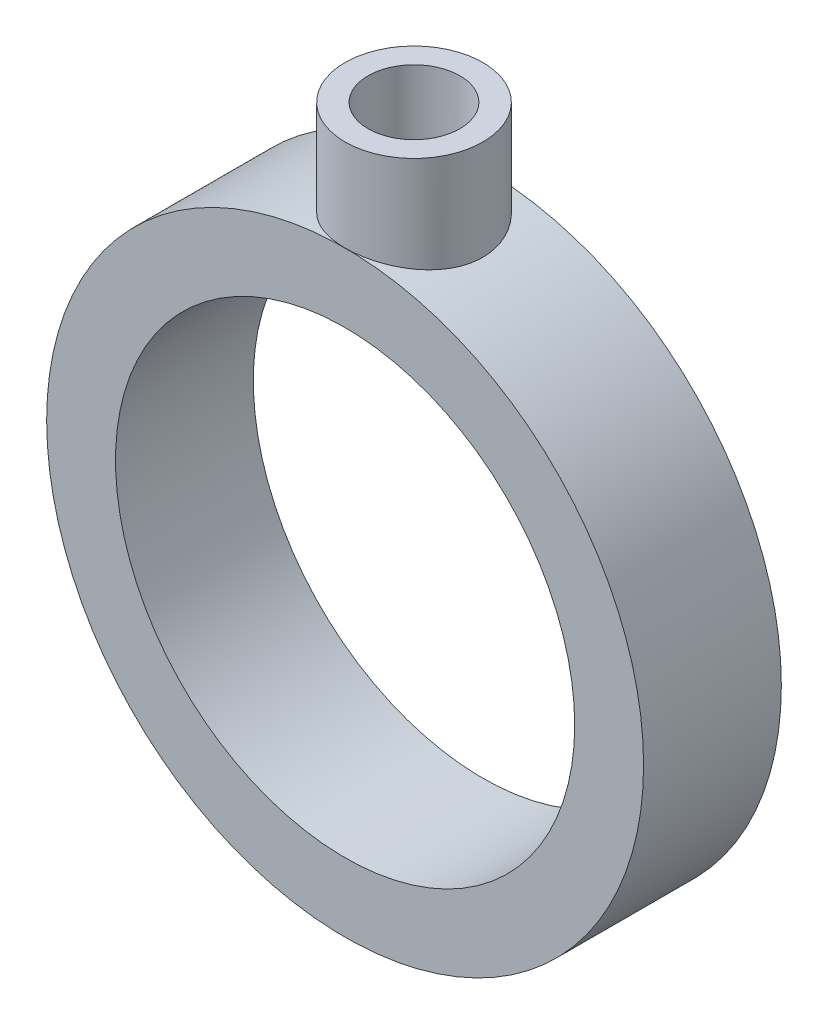
ISO-10303-21;
HEADER;
FILE_DESCRIPTION(('STEP AP214'),'2;1');
FILE_NAME('part.step','',(''),(''),'','','');
FILE_SCHEMA(('AUTOMOTIVE_DESIGN { 1 0 10303 214 1 1 1 1 }'));
ENDSEC;
DATA;
#1=APPLICATION_CONTEXT('core data for automotive mechanical design processes');
#2=APPLICATION_PROTOCOL_DEFINITION('international standard','automotive_design',2000,#1);
#3=PRODUCT_CONTEXT('',#1,'mechanical');
#4=PRODUCT('Part','Part','',(#3));
#5=PRODUCT_RELATED_PRODUCT_CATEGORY('part','',(#4));
#6=PRODUCT_DEFINITION_FORMATION('','',#4);
#7=PRODUCT_DEFINITION_CONTEXT('part definition',#1,'design');
#8=PRODUCT_DEFINITION('design','',#6,#7);
#9=PRODUCT_DEFINITION_SHAPE('','',#8);
#10=(LENGTH_UNIT() NAMED_UNIT(*) SI_UNIT(.MILLI.,.METRE.));
#11=(NAMED_UNIT(*) PLANE_ANGLE_UNIT() SI_UNIT($,.RADIAN.));
#12=(NAMED_UNIT(*) SI_UNIT($,.STERADIAN.) SOLID_ANGLE_UNIT());
#13=UNCERTAINTY_MEASURE_WITH_UNIT(LENGTH_MEASURE(1.E-05),#10,'distance_accuracy_value','');
#14=(GEOMETRIC_REPRESENTATION_CONTEXT(3) GLOBAL_UNCERTAINTY_ASSIGNED_CONTEXT((#13)) GLOBAL_UNIT_ASSIGNED_CONTEXT((#10,
#11,#12)) REPRESENTATION_CONTEXT('',''));
#15=CARTESIAN_POINT('',(0.,0.,0.));
#16=DIRECTION('',(0.,0.,1.));
#17=DIRECTION('',(1.,0.,0.));
#18=AXIS2_PLACEMENT_3D('',#15,#16,#17);
#19=CARTESIAN_POINT('',(0.,0.,3.));
#20=DIRECTION('',(0.,0.,-1.));
#21=DIRECTION('',(-1.,0.,0.));
#22=AXIS2_PLACEMENT_3D('',#19,#20,#21);
#23=CYLINDRICAL_SURFACE('',#22,13.);
#24=CARTESIAN_POINT('',(0.,13.,2.));
#25=CARTESIAN_POINT('',(-0.111634129459772,12.9999981798433,1.99999542300332));
#26=CARTESIAN_POINT('',(-0.223332182929121,12.9985470068655,1.99062180736705));
#27=CARTESIAN_POINT('',(-0.443603799648007,12.9928976712786,1.95338585362346));
#28=CARTESIAN_POINT('',(-0.552174253226696,12.9886968669639,1.92550573504775));
#29=CARTESIAN_POINT('',(-0.762971221767027,12.9780201450358,1.85211155533157));
#30=CARTESIAN_POINT('',(-0.865202549429167,12.9715459788835,1.80661106664727));
#31=CARTESIAN_POINT('',(-1.06056417054209,12.9570371396926,1.69930144504855));
#32=CARTESIAN_POINT('',(-1.15369567594379,12.9490026748879,1.63749448796337));
#33=CARTESIAN_POINT('',(-1.32899277202475,12.9321924031196,1.49878654629));
#34=CARTESIAN_POINT('',(-1.41107292146211,12.923411590907,1.42177817745235));
#35=CARTESIAN_POINT('',(-1.56119998237499,12.9061372591379,1.25508449837165));
#36=CARTESIAN_POINT('',(-1.6292460698243,12.8976437564756,1.16539844426441));
#37=CARTESIAN_POINT('',(-1.74970824234049,12.8818571696186,0.975318277214136));
#38=CARTESIAN_POINT('',(-1.80204125030049,12.874570554198,0.874870930734905));
#39=CARTESIAN_POINT('',(-1.88906073325816,12.8620913537326,0.666481120934637));
#40=CARTESIAN_POINT('',(-1.92374822059573,12.8568986485617,0.558539087994608));
#41=CARTESIAN_POINT('',(-1.97422579132362,12.8492445576298,0.339124209045471));
#42=CARTESIAN_POINT('',(-1.99016243475775,12.8467620000393,0.227685832114845));
#43=CARTESIAN_POINT('',(-2.00314004931484,12.8447450655813,0.00369107009528452));
#44=CARTESIAN_POINT('',(-2.00018216102485,12.8452105107546,-0.108865247098543));
#45=CARTESIAN_POINT('',(-1.97557435962365,12.8490176386625,-0.330863103663462));
#46=CARTESIAN_POINT('',(-1.9540879888833,12.852334155509,-0.440323265109866));
#47=CARTESIAN_POINT('',(-1.89328929394482,12.8614304087006,-0.654066082264418));
#48=CARTESIAN_POINT('',(-1.85397644155405,12.8672102180321,-0.75834858445868));
#49=CARTESIAN_POINT('',(-1.75847159016806,12.8806094791762,-0.95927169770105));
#50=CARTESIAN_POINT('',(-1.7022106216098,12.8882364224677,-1.05587900534495));
#51=CARTESIAN_POINT('',(-1.57445566474822,12.9044652207238,-1.23834374933545));
#52=CARTESIAN_POINT('',(-1.50296062558221,12.9130671429243,-1.32420044344408));
#53=CARTESIAN_POINT('',(-1.3458707741095,12.9303877351212,-1.48367437724266));
#54=CARTESIAN_POINT('',(-1.2601354172487,12.939106680676,-1.55715321407389));
#55=CARTESIAN_POINT('',(-1.07747683573123,12.9555948808269,-1.68870090383103));
#56=CARTESIAN_POINT('',(-0.980553557370509,12.9633641308639,-1.74676968278146));
#57=CARTESIAN_POINT('',(-0.778148209221874,12.977086290908,-1.84585722519084));
#58=CARTESIAN_POINT('',(-0.672660659263364,12.9830380261278,-1.88686496708427));
#59=CARTESIAN_POINT('',(-0.456184081690752,12.992444828946,-1.95054425674362));
#60=CARTESIAN_POINT('',(-0.345195446112753,12.9959000741847,-1.97321710916126));
#61=CARTESIAN_POINT('',(-0.122061413656298,12.999900977609,-1.99939818817922));
#62=CARTESIAN_POINT('',(-0.00993883414831808,13.000475512886,-2.00309662866594));
#63=CARTESIAN_POINT('',(0.213325058692731,12.9987289757846,-1.99172928039578));
#64=CARTESIAN_POINT('',(0.324466403910715,12.9964079978465,-1.97666410363391));
#65=CARTESIAN_POINT('',(0.542034248496511,12.9891490837857,-1.92835534939112));
#66=CARTESIAN_POINT('',(0.648481883728961,12.9842245404646,-1.89520477603376));
#67=CARTESIAN_POINT('',(0.854308287939675,12.9723087739691,-1.81176456563786));
#68=CARTESIAN_POINT('',(0.953686709856465,12.9653174494133,-1.76147408782045));
#69=CARTESIAN_POINT('',(1.14338785915144,12.9499729976666,-1.64473773321354));
#70=CARTESIAN_POINT('',(1.23363576499287,12.94160989393,-1.57817160424487));
#71=CARTESIAN_POINT('',(1.40174739518524,12.9244828841827,-1.43094049058091));
#72=CARTESIAN_POINT('',(1.47961035974428,12.9157189536244,-1.35027464153208));
#73=CARTESIAN_POINT('',(1.62143687177062,12.8986860695372,-1.17628566905066));
#74=CARTESIAN_POINT('',(1.68527268254131,12.8904221246483,-1.08285785594592));
#75=CARTESIAN_POINT('',(1.79634400375255,12.8754146609527,-0.886493623548419));
#76=CARTESIAN_POINT('',(1.84357998078108,12.8686710994129,-0.78355747161868));
#77=CARTESIAN_POINT('',(1.91991433220861,12.8575044908204,-0.571474165015271));
#78=CARTESIAN_POINT('',(1.94907911782486,12.8530729567255,-0.462351380158461));
#79=CARTESIAN_POINT('',(1.98865407244709,12.8470098709954,-0.240682987796808));
#80=CARTESIAN_POINT('',(1.99906561003298,12.8453781150375,-0.128137630675036));
#81=CARTESIAN_POINT('',(2.00080471457037,12.8451072329882,0.0959074702454619));
#82=CARTESIAN_POINT('',(1.99233317092469,12.8464366045642,0.207405668335099));
#83=CARTESIAN_POINT('',(1.95697794807654,12.8518695985565,0.427371210054106));
#84=CARTESIAN_POINT('',(1.93009430462956,12.8559732155853,0.535838559568827));
#85=CARTESIAN_POINT('',(1.85875038208619,12.8664810988442,0.746602841237628));
#86=CARTESIAN_POINT('',(1.81430487035791,12.8728834317255,0.848904874579072));
#87=CARTESIAN_POINT('',(1.7091189717658,12.8872696044033,1.04463266898111));
#88=CARTESIAN_POINT('',(1.64837797557981,12.8952535033351,1.13805809795002));
#89=CARTESIAN_POINT('',(1.51159830040354,12.9120041996598,1.31440009714407));
#90=CARTESIAN_POINT('',(1.43541104590757,12.9207781015993,1.39720076396871));
#91=CARTESIAN_POINT('',(1.27021551598636,12.9380614876198,1.54891276196269));
#92=CARTESIAN_POINT('',(1.18120427010544,12.9465709098818,1.61782086626289));
#93=CARTESIAN_POINT('',(0.992277722296824,12.9624232087798,1.74015121411183));
#94=CARTESIAN_POINT('',(0.892302099536091,12.9697590240101,1.79348120339238));
#95=CARTESIAN_POINT('',(0.68474512681887,12.9823684829832,1.88251146342835));
#96=CARTESIAN_POINT('',(0.577171717906741,12.9876442432633,1.91822983864098));
#97=CARTESIAN_POINT('',(0.390941400069084,12.9943465728122,1.96299713746939));
#98=CARTESIAN_POINT('',(0.313429175326516,12.9964556222015,1.97685178146002));
#99=CARTESIAN_POINT('',(0.157288536394365,12.9992829677305,1.99535476350691));
#100=CARTESIAN_POINT('',(0.0786601371924722,13.0000012825269,2.00000322506377));
#101=CARTESIAN_POINT('',(0.,13.,2.));
#102=B_SPLINE_CURVE_WITH_KNOTS('',3,(#24,#25,#26,#27,#28,#29,#30,#31,#32,#33,#34,#35,#36,#37,
#38,#39,#40,#41,#42,#43,#44,#45,#46,#47,#48,#49,#50,#51,#52,#53,#54,#55,#56,#57,#58,#59,#60,#61,
#62,#63,#64,#65,#66,#67,#68,#69,#70,#71,#72,#73,#74,#75,#76,#77,#78,#79,#80,#81,#82,#83,#84,#85,
#86,#87,#88,#89,#90,#91,#92,#93,#94,#95,#96,#97,#98,#99,#100,#101),.UNSPECIFIED.,.T.,.F.,(4,2,2,
2,2,2,2,2,2,2,2,2,2,2,2,2,2,2,2,2,2,2,2,2,2,2,2,2,2,2,2,2,2,2,2,2,2,2,4),(0.,0.334614935402754,
0.669551824578953,1.00423123317535,1.33886600689116,1.6759552066042,2.0130641932687,
2.35192534458354,2.69076705292645,3.02694233717946,3.36309732807122,3.69631525463016,
4.02954305496923,4.36414566185345,4.69877135746454,5.03692069824302,5.37507166226688,
5.71344073657471,6.05178573150937,6.38673217834278,6.72166770083347,7.05489683473247,
7.38814231716764,7.72392860544463,8.05973548561447,8.39848409534481,8.73722318277052,
9.07470991155934,9.41217201014685,9.74606114027121,10.0799496219992,10.4135579400877,
10.7471787342265,11.0841753844584,11.4212502200089,11.7602825362116,12.0989656022034,
12.3347466304,12.5705244955816),.UNSPECIFIED.);
#103=CARTESIAN_POINT('',(0.,13.,2.));
#104=VERTEX_POINT('',#103);
#105=EDGE_CURVE('E51',#104,#104,#102,.T.);
#106=ORIENTED_EDGE('',*,*,#105,.F.);
#107=EDGE_LOOP('',(#106));
#108=FACE_BOUND('',#107,.T.);
#109=CARTESIAN_POINT('',(0.,13.,3.));
#110=CARTESIAN_POINT('',(0.166152344952669,12.9999969906573,2.99999466928822));
#111=CARTESIAN_POINT('',(0.332367205973653,12.9967824842909,2.98615014637782));
#112=CARTESIAN_POINT('',(0.660059866493254,12.9842700075106,2.9312047142287));
#113=CARTESIAN_POINT('',(0.821534467366725,12.9749680237034,2.89008582311719));
#114=CARTESIAN_POINT('',(1.13496480129888,12.9513142129353,2.78196060211815));
#115=CARTESIAN_POINT('',(1.28693082086391,12.936967958219,2.71498282973731));
#116=CARTESIAN_POINT('',(1.577465910561,12.904766336637,2.55713546986327));
#117=CARTESIAN_POINT('',(1.71603502567188,12.8869109815535,2.46626596258808));
#118=CARTESIAN_POINT('',(1.97830470624641,12.8492864660987,2.26150949664556));
#119=CARTESIAN_POINT('',(2.10173358432239,12.8294913730764,2.14727927659515));
#120=CARTESIAN_POINT('',(2.32786120795392,12.7903971901517,1.89978014685717));
#121=CARTESIAN_POINT('',(2.43055793299828,12.7710981487534,1.76650938367844));
#122=CARTESIAN_POINT('',(2.61353391505112,12.7349234835873,1.48266614487996));
#123=CARTESIAN_POINT('',(2.69351850955545,12.7180809816988,1.33189911804872));
#124=CARTESIAN_POINT('',(2.82690790660153,12.6891009206901,1.01860980269649));
#125=CARTESIAN_POINT('',(2.88031627708408,12.6769627300499,0.856089095500928));
#126=CARTESIAN_POINT('',(2.95812848517193,12.659030692131,0.526868396835621));
#127=CARTESIAN_POINT('',(2.98301618993589,12.6531311408672,0.360288653266906));
#128=CARTESIAN_POINT('',(3.00458614092873,12.6480272975283,0.0252218259293454));
#129=CARTESIAN_POINT('',(3.00127226312641,12.6488220853967,-0.143264992556277));
#130=CARTESIAN_POINT('',(2.96692126571465,12.6569216667427,-0.473725615648721));
#131=CARTESIAN_POINT('',(2.93645150630372,12.6640932250769,-0.635762162688184));
#132=CARTESIAN_POINT('',(2.8495548295868,12.683927027642,-0.952359583802944));
#133=CARTESIAN_POINT('',(2.79312630925338,12.6965896109567,-1.10691999555408));
#134=CARTESIAN_POINT('',(2.65540698150097,12.726106644567,-1.40574534328195));
#135=CARTESIAN_POINT('',(2.57390258493056,12.7429968648251,-1.54990816182197));
#136=CARTESIAN_POINT('',(2.3884949795051,12.7790447936328,-1.82271847257873));
#137=CARTESIAN_POINT('',(2.28458839291061,12.7982028439228,-1.95136362051804));
#138=CARTESIAN_POINT('',(2.05434642172906,12.8371955528176,-2.19274790010195));
#139=CARTESIAN_POINT('',(1.92752990169011,12.8570353769547,-2.30502777024993));
#140=CARTESIAN_POINT('',(1.65663728210681,12.8947363213875,-2.50680614195071));
#141=CARTESIAN_POINT('',(1.51256079749006,12.91259739752,-2.59630413509717));
#142=CARTESIAN_POINT('',(1.21064255594474,12.94439708166,-2.75011182828663));
#143=CARTESIAN_POINT('',(1.0527662865885,12.9583254640484,-2.81435603138533));
#144=CARTESIAN_POINT('',(0.728064792505166,12.980615159728,-2.9152722873901));
#145=CARTESIAN_POINT('',(0.561241024748476,12.9889773764326,-2.95194881477694));
#146=CARTESIAN_POINT('',(0.227314647863281,12.999062058904,-2.99600830069629));
#147=CARTESIAN_POINT('',(0.0602988900254598,13.0009265305377,-3.00401787211947));
#148=CARTESIAN_POINT('',(-0.272684743158447,12.9982059982626,-2.99222197048143));
#149=CARTESIAN_POINT('',(-0.438652697125491,12.9936214841662,-2.972418609864));
#150=CARTESIAN_POINT('',(-0.762715807596045,12.9786082469926,-2.90607760678847));
#151=CARTESIAN_POINT('',(-0.920882929751393,12.968252478837,-2.85987351736574));
#152=CARTESIAN_POINT('',(-1.22721924496333,12.9428582085761,-2.74241682215124));
#153=CARTESIAN_POINT('',(-1.3753875214532,12.9278192778858,-2.67116192372823));
#154=CARTESIAN_POINT('',(-1.66007523022035,12.8943799217624,-2.50435471215811));
#155=CARTESIAN_POINT('',(-1.79637682059256,12.8759307059183,-2.4084406162299));
#156=CARTESIAN_POINT('',(-2.05117436096366,12.8378078382851,-2.19550876528259));
#157=CARTESIAN_POINT('',(-2.16966771329558,12.8181340084537,-2.07848793691579));
#158=CARTESIAN_POINT('',(-2.38800205666,12.7792809496474,-1.82377522824305));
#159=CARTESIAN_POINT('',(-2.48740687177955,12.7601203499969,-1.68570607064937));
#160=CARTESIAN_POINT('',(-2.66162470892947,12.7249237700036,-1.39446823956527));
#161=CARTESIAN_POINT('',(-2.73643882449717,12.7088876507294,-1.24130023790751));
#162=CARTESIAN_POINT('',(-2.85882133736006,12.6819190230073,-0.925048023164727));
#163=CARTESIAN_POINT('',(-2.90654808960746,12.6709569224205,-0.762027740678969));
#164=CARTESIAN_POINT('',(-2.9738506135118,12.6553320099168,-0.429992014353495));
#165=CARTESIAN_POINT('',(-2.99343148198756,12.6506680575041,-0.260977661636089));
#166=CARTESIAN_POINT('',(-3.00365072031913,12.6482450687886,0.0738364541144728));
#167=CARTESIAN_POINT('',(-2.99498255743034,12.6503205850391,0.239614221299587));
#168=CARTESIAN_POINT('',(-2.95051371961671,12.6607654071459,0.56727735733389));
#169=CARTESIAN_POINT('',(-2.91471344248813,12.6691346207273,0.729162783214562));
#170=CARTESIAN_POINT('',(-2.81734841440311,12.6911387833219,1.04381982158291));
#171=CARTESIAN_POINT('',(-2.7558954206715,12.7047508718617,1.19662772141188));
#172=CARTESIAN_POINT('',(-2.60906164454194,12.7357136622437,1.48986361308248));
#173=CARTESIAN_POINT('',(-2.52367805163027,12.7530648031611,1.63029014825466));
#174=CARTESIAN_POINT('',(-2.32915359032528,12.7900365874876,1.8981710571802));
#175=CARTESIAN_POINT('',(-2.21952324066575,12.8096993736488,2.02526423909917));
#176=CARTESIAN_POINT('',(-1.98059542918642,12.8488080487622,2.25947649527657));
#177=CARTESIAN_POINT('',(-1.85129339204876,12.8682538861233,2.36659090986055));
#178=CARTESIAN_POINT('',(-1.57438386552311,12.9050799859908,2.55933453589763));
#179=CARTESIAN_POINT('',(-1.42653373816978,12.9224254113505,2.64462223657955));
#180=CARTESIAN_POINT('',(-1.11821928295074,12.9527409110575,2.78899829881722));
#181=CARTESIAN_POINT('',(-0.957765094203872,12.9657144587282,2.84810747020586));
#182=CARTESIAN_POINT('',(-0.664420748397538,12.9836544679345,2.92855694711147));
#183=CARTESIAN_POINT('',(-0.533052734642019,12.989744579336,2.955294542054));
#184=CARTESIAN_POINT('',(-0.267803260561671,12.9979184490222,2.99101773322944));
#185=CARTESIAN_POINT('',(-0.133921937579662,13.0000024255872,3.00000429665468));
#186=CARTESIAN_POINT('',(0.,13.,3.));
#187=B_SPLINE_CURVE_WITH_KNOTS('',3,(#109,#110,#111,#112,#113,#114,#115,#116,#117,#118,#119,
#120,#121,#122,#123,#124,#125,#126,#127,#128,#129,#130,#131,#132,#133,#134,#135,#136,#137,#138,
#139,#140,#141,#142,#143,#144,#145,#146,#147,#148,#149,#150,#151,#152,#153,#154,#155,#156,#157,
#158,#159,#160,#161,#162,#163,#164,#165,#166,#167,#168,#169,#170,#171,#172,#173,#174,#175,#176,
#177,#178,#179,#180,#181,#182,#183,#184,#185,#186),.UNSPECIFIED.,.T.,.F.,(4,2,2,2,2,2,2,2,2,2,2,
2,2,2,2,2,2,2,2,2,2,2,2,2,2,2,2,2,2,2,2,2,2,2,2,2,2,2,4),(0.,0.497966622434228,
0.996261878862197,1.49400840494549,1.9917532598344,2.49741860444443,3.00313320634929,
3.51513680218821,4.02707164139241,4.53018632285289,5.03323185836015,5.52600755521466,
6.01881368645778,6.51593939429341,7.01314010983494,7.52235052563831,8.03157230411895,
8.54210619550815,9.05255720476822,9.55178002870641,10.0509649377955,10.5439782351977,
11.0370366645577,11.5377886750691,12.0386136589454,12.5497908111456,13.0609452284513,
13.5690797726974,14.0771222894149,14.5727880288599,15.0684465012649,15.5619677862172,
16.0555470567626,16.5601864742807,17.0649434427466,17.5771721946325,18.088993031651,
18.4903854337741,18.8917559648093),.UNSPECIFIED.);
#188=CARTESIAN_POINT('',(0.,13.,3.));
#189=VERTEX_POINT('',#188);
#190=EDGE_CURVE('E47',#189,#189,#187,.T.);
#191=ORIENTED_EDGE('',*,*,#190,.F.);
#192=EDGE_LOOP('',(#191));
#193=FACE_BOUND('',#192,.T.);
#194=ADVANCED_FACE('F39',(#108,#193),#23,.F.);
#195=CARTESIAN_POINT('',(0.,17.,0.));
#196=DIRECTION('',(0.,1.,0.));
#197=DIRECTION('',(0.,0.,1.));
#198=AXIS2_PLACEMENT_3D('',#195,#196,#197);
#199=PLANE('',#198);
#200=CARTESIAN_POINT('',(0.,17.,0.));
#201=DIRECTION('',(0.,1.,0.));
#202=DIRECTION('',(0.,0.,1.));
#203=AXIS2_PLACEMENT_3D('',#200,#201,#202);
#204=CIRCLE('',#203,2.);
#205=CARTESIAN_POINT('',(0.,17.,2.));
#206=VERTEX_POINT('',#205);
#207=EDGE_CURVE('E55',#206,#206,#204,.T.);
#208=ORIENTED_EDGE('',*,*,#207,.F.);
#209=EDGE_LOOP('',(#208));
#210=FACE_BOUND('',#209,.T.);
#211=CARTESIAN_POINT('',(0.,17.,0.));
#212=DIRECTION('',(0.,1.,0.));
#213=DIRECTION('',(0.,0.,1.));
#214=AXIS2_PLACEMENT_3D('',#211,#212,#213);
#215=CIRCLE('',#214,3.);
#216=CARTESIAN_POINT('',(0.,17.,3.));
#217=VERTEX_POINT('',#216);
#218=EDGE_CURVE('E11',#217,#217,#215,.T.);
#219=ORIENTED_EDGE('',*,*,#218,.T.);
#220=EDGE_LOOP('',(#219));
#221=FACE_BOUND('',#220,.T.);
#222=ADVANCED_FACE('F68',(#210,#221),#199,.T.);
#223=CARTESIAN_POINT('',(0.,-13.002,0.));
#224=DIRECTION('',(0.,1.,0.));
#225=DIRECTION('',(0.,0.,1.));
#226=AXIS2_PLACEMENT_3D('',#223,#224,#225);
#227=CYLINDRICAL_SURFACE('',#226,3.);
#228=ORIENTED_EDGE('',*,*,#218,.F.);
#229=EDGE_LOOP('',(#228));
#230=FACE_BOUND('',#229,.T.);
#231=ORIENTED_EDGE('',*,*,#190,.T.);
#232=EDGE_LOOP('',(#231));
#233=FACE_BOUND('',#232,.T.);
#234=ADVANCED_FACE('F41',(#230,#233),#227,.T.);
#235=CARTESIAN_POINT('',(0.,7.,0.));
#236=DIRECTION('',(0.,1.,0.));
#237=DIRECTION('',(0.,0.,1.));
#238=AXIS2_PLACEMENT_3D('',#235,#236,#237);
#239=CYLINDRICAL_SURFACE('',#238,2.);
#240=ORIENTED_EDGE('',*,*,#105,.T.);
#241=EDGE_LOOP('',(#240));
#242=FACE_BOUND('',#241,.T.);
#243=ORIENTED_EDGE('',*,*,#207,.T.);
#244=EDGE_LOOP('',(#243));
#245=FACE_BOUND('',#244,.T.);
#246=ADVANCED_FACE('F73',(#242,#245),#239,.F.);
#247=CLOSED_SHELL('',(#194,#222,#234,#246));
#248=MANIFOLD_SOLID_BREP('B2',#247);
#249=CARTESIAN_POINT('',(0.,0.,3.));
#250=DIRECTION('',(0.,0.,1.));
#251=DIRECTION('',(1.,0.,0.));
#252=AXIS2_PLACEMENT_3D('',#249,#250,#251);
#253=PLANE('',#252);
#254=CARTESIAN_POINT('',(0.,0.,3.));
#255=DIRECTION('',(0.,0.,1.));
#256=DIRECTION('',(1.,0.,0.));
#257=AXIS2_PLACEMENT_3D('',#254,#255,#256);
#258=CIRCLE('',#257,13.);
#259=CARTESIAN_POINT('',(13.,0.,3.));
#260=VERTEX_POINT('',#259);
#261=EDGE_CURVE('E38',#260,#260,#258,.T.);
#262=ORIENTED_EDGE('',*,*,#261,.T.);
#263=EDGE_LOOP('',(#262));
#264=FACE_BOUND('',#263,.T.);
#265=CARTESIAN_POINT('',(0.,0.,3.));
#266=DIRECTION('',(0.,0.,1.));
#267=DIRECTION('',(1.,0.,0.));
#268=AXIS2_PLACEMENT_3D('',#265,#266,#267);
#269=CIRCLE('',#268,10.);
#270=CARTESIAN_POINT('',(10.,0.,3.));
#271=VERTEX_POINT('',#270);
#272=EDGE_CURVE('E130',#271,#271,#269,.T.);
#273=ORIENTED_EDGE('',*,*,#272,.F.);
#274=EDGE_LOOP('',(#273));
#275=FACE_BOUND('',#274,.T.);
#276=ADVANCED_FACE('F111',(#264,#275),#253,.T.);
#277=CARTESIAN_POINT('',(0.,0.,-3.));
#278=DIRECTION('',(0.,0.,1.));
#279=DIRECTION('',(1.,0.,0.));
#280=AXIS2_PLACEMENT_3D('',#277,#278,#279);
#281=PLANE('',#280);
#282=CARTESIAN_POINT('',(0.,0.,-3.));
#283=DIRECTION('',(0.,0.,1.));
#284=DIRECTION('',(1.,0.,0.));
#285=AXIS2_PLACEMENT_3D('',#282,#283,#284);
#286=CIRCLE('',#285,13.);
#287=CARTESIAN_POINT('',(13.,0.,-3.));
#288=VERTEX_POINT('',#287);
#289=EDGE_CURVE('E125',#288,#288,#286,.T.);
#290=ORIENTED_EDGE('',*,*,#289,.F.);
#291=EDGE_LOOP('',(#290));
#292=FACE_BOUND('',#291,.T.);
#293=CARTESIAN_POINT('',(0.,0.,-3.));
#294=DIRECTION('',(0.,0.,1.));
#295=DIRECTION('',(1.,0.,0.));
#296=AXIS2_PLACEMENT_3D('',#293,#294,#295);
#297=CIRCLE('',#296,10.);
#298=CARTESIAN_POINT('',(10.,0.,-3.));
#299=VERTEX_POINT('',#298);
#300=EDGE_CURVE('E132',#299,#299,#297,.T.);
#301=ORIENTED_EDGE('',*,*,#300,.T.);
#302=EDGE_LOOP('',(#301));
#303=FACE_BOUND('',#302,.T.);
#304=ADVANCED_FACE('F153',(#292,#303),#281,.F.);
#305=CARTESIAN_POINT('',(0.,0.,3.));
#306=DIRECTION('',(0.,0.,-1.));
#307=DIRECTION('',(-1.,0.,0.));
#308=AXIS2_PLACEMENT_3D('',#305,#306,#307);
#309=CYLINDRICAL_SURFACE('',#308,13.);
#310=CARTESIAN_POINT('',(0.,13.,2.));
#311=CARTESIAN_POINT('',(-0.111634129459772,12.9999981798433,1.99999542300332));
#312=CARTESIAN_POINT('',(-0.223332182929121,12.9985470068655,1.99062180736705));
#313=CARTESIAN_POINT('',(-0.443603799648007,12.9928976712786,1.95338585362346));
#314=CARTESIAN_POINT('',(-0.552174253226696,12.9886968669639,1.92550573504775));
#315=CARTESIAN_POINT('',(-0.762971221767027,12.9780201450358,1.85211155533157));
#316=CARTESIAN_POINT('',(-0.865202549429167,12.9715459788835,1.80661106664727));
#317=CARTESIAN_POINT('',(-1.06056417054209,12.9570371396926,1.69930144504855));
#318=CARTESIAN_POINT('',(-1.15369567594379,12.9490026748879,1.63749448796337));
#319=CARTESIAN_POINT('',(-1.32899277202475,12.9321924031196,1.49878654629));
#320=CARTESIAN_POINT('',(-1.41107292146211,12.923411590907,1.42177817745235));
#321=CARTESIAN_POINT('',(-1.56119998237499,12.9061372591379,1.25508449837165));
#322=CARTESIAN_POINT('',(-1.6292460698243,12.8976437564756,1.16539844426441));
#323=CARTESIAN_POINT('',(-1.74970824234049,12.8818571696186,0.975318277214136));
#324=CARTESIAN_POINT('',(-1.80204125030049,12.874570554198,0.874870930734905));
#325=CARTESIAN_POINT('',(-1.88906073325816,12.8620913537326,0.666481120934637));
#326=CARTESIAN_POINT('',(-1.92374822059573,12.8568986485617,0.558539087994608));
#327=CARTESIAN_POINT('',(-1.97422579132362,12.8492445576298,0.339124209045471));
#328=CARTESIAN_POINT('',(-1.99016243475775,12.8467620000393,0.227685832114845));
#329=CARTESIAN_POINT('',(-2.00314004931484,12.8447450655813,0.00369107009528452));
#330=CARTESIAN_POINT('',(-2.00018216102485,12.8452105107546,-0.108865247098543));
#331=CARTESIAN_POINT('',(-1.97557435962365,12.8490176386625,-0.330863103663462));
#332=CARTESIAN_POINT('',(-1.9540879888833,12.852334155509,-0.440323265109866));
#333=CARTESIAN_POINT('',(-1.89328929394482,12.8614304087006,-0.654066082264418));
#334=CARTESIAN_POINT('',(-1.85397644155405,12.8672102180321,-0.75834858445868));
#335=CARTESIAN_POINT('',(-1.75847159016806,12.8806094791762,-0.95927169770105));
#336=CARTESIAN_POINT('',(-1.7022106216098,12.8882364224677,-1.05587900534495));
#337=CARTESIAN_POINT('',(-1.57445566474822,12.9044652207238,-1.23834374933545));
#338=CARTESIAN_POINT('',(-1.50296062558221,12.9130671429243,-1.32420044344408));
#339=CARTESIAN_POINT('',(-1.3458707741095,12.9303877351212,-1.48367437724266));
#340=CARTESIAN_POINT('',(-1.2601354172487,12.939106680676,-1.55715321407389));
#341=CARTESIAN_POINT('',(-1.07747683573123,12.9555948808269,-1.68870090383103));
#342=CARTESIAN_POINT('',(-0.980553557370509,12.9633641308639,-1.74676968278146));
#343=CARTESIAN_POINT('',(-0.778148209221874,12.977086290908,-1.84585722519084));
#344=CARTESIAN_POINT('',(-0.672660659263364,12.9830380261278,-1.88686496708427));
#345=CARTESIAN_POINT('',(-0.456184081690752,12.992444828946,-1.95054425674362));
#346=CARTESIAN_POINT('',(-0.345195446112753,12.9959000741847,-1.97321710916126));
#347=CARTESIAN_POINT('',(-0.122061413656298,12.999900977609,-1.99939818817922));
#348=CARTESIAN_POINT('',(-0.00993883414831808,13.000475512886,-2.00309662866594));
#349=CARTESIAN_POINT('',(0.213325058692731,12.9987289757846,-1.99172928039578));
#350=CARTESIAN_POINT('',(0.324466403910715,12.9964079978465,-1.97666410363391));
#351=CARTESIAN_POINT('',(0.542034248496511,12.9891490837857,-1.92835534939112));
#352=CARTESIAN_POINT('',(0.648481883728961,12.9842245404646,-1.89520477603376));
#353=CARTESIAN_POINT('',(0.854308287939675,12.9723087739691,-1.81176456563786));
#354=CARTESIAN_POINT('',(0.953686709856465,12.9653174494133,-1.76147408782045));
#355=CARTESIAN_POINT('',(1.14338785915144,12.9499729976666,-1.64473773321354));
#356=CARTESIAN_POINT('',(1.23363576499287,12.94160989393,-1.57817160424487));
#357=CARTESIAN_POINT('',(1.40174739518524,12.9244828841827,-1.43094049058091));
#358=CARTESIAN_POINT('',(1.47961035974428,12.9157189536244,-1.35027464153208));
#359=CARTESIAN_POINT('',(1.62143687177062,12.8986860695372,-1.17628566905066));
#360=CARTESIAN_POINT('',(1.68527268254131,12.8904221246483,-1.08285785594592));
#361=CARTESIAN_POINT('',(1.79634400375255,12.8754146609527,-0.886493623548419));
#362=CARTESIAN_POINT('',(1.84357998078108,12.8686710994129,-0.78355747161868));
#363=CARTESIAN_POINT('',(1.91991433220861,12.8575044908204,-0.571474165015271));
#364=CARTESIAN_POINT('',(1.94907911782486,12.8530729567255,-0.462351380158461));
#365=CARTESIAN_POINT('',(1.98865407244709,12.8470098709954,-0.240682987796808));
#366=CARTESIAN_POINT('',(1.99906561003298,12.8453781150375,-0.128137630675036));
#367=CARTESIAN_POINT('',(2.00080471457037,12.8451072329882,0.0959074702454619));
#368=CARTESIAN_POINT('',(1.99233317092469,12.8464366045642,0.207405668335099));
#369=CARTESIAN_POINT('',(1.95697794807654,12.8518695985565,0.427371210054106));
#370=CARTESIAN_POINT('',(1.93009430462956,12.8559732155853,0.535838559568827));
#371=CARTESIAN_POINT('',(1.85875038208619,12.8664810988442,0.746602841237628));
#372=CARTESIAN_POINT('',(1.81430487035791,12.8728834317255,0.848904874579072));
#373=CARTESIAN_POINT('',(1.7091189717658,12.8872696044033,1.04463266898111));
#374=CARTESIAN_POINT('',(1.64837797557981,12.8952535033351,1.13805809795002));
#375=CARTESIAN_POINT('',(1.51159830040354,12.9120041996598,1.31440009714407));
#376=CARTESIAN_POINT('',(1.43541104590757,12.9207781015993,1.39720076396871));
#377=CARTESIAN_POINT('',(1.27021551598636,12.9380614876198,1.54891276196269));
#378=CARTESIAN_POINT('',(1.18120427010544,12.9465709098818,1.61782086626289));
#379=CARTESIAN_POINT('',(0.992277722296824,12.9624232087798,1.74015121411183));
#380=CARTESIAN_POINT('',(0.892302099536091,12.9697590240101,1.79348120339238));
#381=CARTESIAN_POINT('',(0.68474512681887,12.9823684829832,1.88251146342835));
#382=CARTESIAN_POINT('',(0.577171717906741,12.9876442432633,1.91822983864098));
#383=CARTESIAN_POINT('',(0.390941400069084,12.9943465728122,1.96299713746939));
#384=CARTESIAN_POINT('',(0.313429175326516,12.9964556222015,1.97685178146002));
#385=CARTESIAN_POINT('',(0.157288536394365,12.9992829677305,1.99535476350691));
#386=CARTESIAN_POINT('',(0.0786601371924722,13.0000012825269,2.00000322506377));
#387=CARTESIAN_POINT('',(0.,13.,2.));
#388=B_SPLINE_CURVE_WITH_KNOTS('',3,(#310,#311,#312,#313,#314,#315,#316,#317,#318,#319,#320,
#321,#322,#323,#324,#325,#326,#327,#328,#329,#330,#331,#332,#333,#334,#335,#336,#337,#338,#339,
#340,#341,#342,#343,#344,#345,#346,#347,#348,#349,#350,#351,#352,#353,#354,#355,#356,#357,#358,
#359,#360,#361,#362,#363,#364,#365,#366,#367,#368,#369,#370,#371,#372,#373,#374,#375,#376,#377,
#378,#379,#380,#381,#382,#383,#384,#385,#386,#387),.UNSPECIFIED.,.T.,.F.,(4,2,2,2,2,2,2,2,2,2,2,
2,2,2,2,2,2,2,2,2,2,2,2,2,2,2,2,2,2,2,2,2,2,2,2,2,2,2,4),(0.,0.334614935402754,
0.669551824578953,1.00423123317535,1.33886600689116,1.6759552066042,2.0130641932687,
2.35192534458354,2.69076705292645,3.02694233717946,3.36309732807122,3.69631525463016,
4.02954305496923,4.36414566185345,4.69877135746454,5.03692069824302,5.37507166226688,
5.71344073657471,6.05178573150937,6.38673217834278,6.72166770083347,7.05489683473247,
7.38814231716764,7.72392860544463,8.05973548561447,8.39848409534481,8.73722318277052,
9.07470991155934,9.41217201014685,9.74606114027121,10.0799496219992,10.4135579400877,
10.7471787342265,11.0841753844584,11.4212502200089,11.7602825362116,12.0989656022034,
12.3347466304,12.5705244955816),.UNSPECIFIED.);
#389=CARTESIAN_POINT('',(0.,13.,2.));
#390=VERTEX_POINT('',#389);
#391=EDGE_CURVE('E135',#390,#390,#388,.T.);
#392=ORIENTED_EDGE('',*,*,#391,.T.);
#393=EDGE_LOOP('',(#392));
#394=FACE_BOUND('',#393,.T.);
#395=ORIENTED_EDGE('',*,*,#261,.F.);
#396=EDGE_LOOP('',(#395));
#397=FACE_BOUND('',#396,.T.);
#398=ORIENTED_EDGE('',*,*,#289,.T.);
#399=EDGE_LOOP('',(#398));
#400=FACE_BOUND('',#399,.T.);
#401=ADVANCED_FACE('F113',(#394,#397,#400),#309,.T.);
#402=CARTESIAN_POINT('',(0.,0.,3.));
#403=DIRECTION('',(0.,0.,-1.));
#404=DIRECTION('',(-1.,0.,0.));
#405=AXIS2_PLACEMENT_3D('',#402,#403,#404);
#406=CYLINDRICAL_SURFACE('',#405,10.);
#407=CARTESIAN_POINT('',(0.,10.,2.));
#408=CARTESIAN_POINT('',(-0.111153813585266,9.99999795161742,1.99999591100331));
#409=CARTESIAN_POINT('',(-0.222359320403045,9.99812770356462,1.99070231406471));
#410=CARTESIAN_POINT('',(-0.441627015378038,9.99084731246463,1.95380299976951));
#411=CARTESIAN_POINT('',(-0.549686635082711,9.98543435720372,1.92618273439698));
#412=CARTESIAN_POINT('',(-0.759460610526625,9.97167298556573,1.85351745275842));
#413=CARTESIAN_POINT('',(-0.861180935866268,9.96332738153436,1.80848912631062));
#414=CARTESIAN_POINT('',(-1.05561597772845,9.94460796070629,1.70233550497741));
#415=CARTESIAN_POINT('',(-1.14833123015162,9.93423426471414,1.64121116878559));
#416=CARTESIAN_POINT('',(-1.32338695462973,9.9124433065994,1.50372301141713));
#417=CARTESIAN_POINT('',(-1.40558790231705,9.90101491008695,1.4271832892176));
#418=CARTESIAN_POINT('',(-1.55607351321606,9.87848360905177,1.2614151672166));
#419=CARTESIAN_POINT('',(-1.62435708954085,9.86738073000848,1.17218577732976));
#420=CARTESIAN_POINT('',(-1.74566350669524,9.8466488362523,0.98256761397625));
#421=CARTESIAN_POINT('',(-1.79854187773173,9.83703414729892,0.882084712407282));
#422=CARTESIAN_POINT('',(-1.88661133316062,9.82052536116836,0.673436361991842));
#423=CARTESIAN_POINT('',(-1.92180416487448,9.81363099523923,0.565271673307311));
#424=CARTESIAN_POINT('',(-1.97305059976965,9.80345610504409,0.345831272184166));
#425=CARTESIAN_POINT('',(-1.98934899591755,9.80012940214375,0.234614911715548));
#426=CARTESIAN_POINT('',(-2.00310425545224,9.79732750121254,0.0109803572713156));
#427=CARTESIAN_POINT('',(-2.000563045427,9.79785190935681,-0.10143771264029));
#428=CARTESIAN_POINT('',(-1.97690914620364,9.80265102296369,-0.322493576042006));
#429=CARTESIAN_POINT('',(-1.95607708048781,9.80686905717527,-0.431162811254627));
#430=CARTESIAN_POINT('',(-1.8968757692461,9.81849092320002,-0.643432153326004));
#431=CARTESIAN_POINT('',(-1.85850568620136,9.82589490715558,-0.747032017838015));
#432=CARTESIAN_POINT('',(-1.76504956734944,9.84311237000816,-0.947030523407198));
#433=CARTESIAN_POINT('',(-1.70985230246423,9.85294179627409,-1.04337575913834));
#434=CARTESIAN_POINT('',(-1.58438714914536,9.87389237546124,-1.22554169994563));
#435=CARTESIAN_POINT('',(-1.51411752871366,9.88501367676732,-1.31136119370231));
#436=CARTESIAN_POINT('',(-1.35899986912117,9.90754042482924,-1.47165880491387));
#437=CARTESIAN_POINT('',(-1.27391232242489,9.9189473842181,-1.54590513571826));
#438=CARTESIAN_POINT('',(-1.09237004812402,9.94057697428817,-1.67910769260245));
#439=CARTESIAN_POINT('',(-0.995915174758779,9.95079958977947,-1.73806372258716));
#440=CARTESIAN_POINT('',(-0.794118773757842,9.96893380321774,-1.83905501845195));
#441=CARTESIAN_POINT('',(-0.688763639170601,9.97684177696544,-1.88106378728907));
#442=CARTESIAN_POINT('',(-0.47229795289733,9.98942817975716,-1.94672094807713));
#443=CARTESIAN_POINT('',(-0.361188100144899,9.99410700001063,-1.97037156414726));
#444=CARTESIAN_POINT('',(-0.138358811254301,9.99965343733735,-1.99831290758855));
#445=CARTESIAN_POINT('',(-0.0266806566511527,10.0005834930494,-2.00292083908054));
#446=CARTESIAN_POINT('',(0.195849868385428,9.99870103860205,-1.99350028211564));
#447=CARTESIAN_POINT('',(0.306702284887586,9.99588873882892,-1.97947284129481));
#448=CARTESIAN_POINT('',(0.523411319893081,9.98687664016035,-1.93344325291209));
#449=CARTESIAN_POINT('',(0.629303896679806,9.98070752808413,-1.90160386300419));
#450=CARTESIAN_POINT('',(0.834247254999334,9.96567104122065,-1.82103203468838));
#451=CARTESIAN_POINT('',(0.933297523275079,9.95680346428454,-1.77229833064634));
#452=CARTESIAN_POINT('',(1.12308234737243,9.93719823066589,-1.65863501869737));
#453=CARTESIAN_POINT('',(1.21370025350438,9.92643900874103,-1.59351443792211));
#454=CARTESIAN_POINT('',(1.38283603823841,9.90429469659765,-1.44918161758544));
#455=CARTESIAN_POINT('',(1.46135261786152,9.89290953936776,-1.36996786720027));
#456=CARTESIAN_POINT('',(1.60528118154835,9.8705860711393,-1.19825329621775));
#457=CARTESIAN_POINT('',(1.67047540489731,9.85965720466609,-1.10556851155733));
#458=CARTESIAN_POINT('',(1.78437084010241,9.83968383592389,-0.910377277286642));
#459=CARTESIAN_POINT('',(1.83307271184581,9.83063925826685,-0.807871220852895));
#460=CARTESIAN_POINT('',(1.91230368316392,9.81553481168766,-0.596463507700903));
#461=CARTESIAN_POINT('',(1.9429269995821,9.80945949744373,-0.487598317579362));
#462=CARTESIAN_POINT('',(1.98541730325439,9.8009487358405,-0.26613309301819));
#463=CARTESIAN_POINT('',(1.99728673645022,9.79851281382223,-0.153533547581305));
#464=CARTESIAN_POINT('',(2.00184182173494,9.79758299262758,0.0700177290886371));
#465=CARTESIAN_POINT('',(1.99487157614179,9.79901838378602,0.180962297854019));
#466=CARTESIAN_POINT('',(1.96270460820012,9.80551146969228,0.400063299810053));
#467=CARTESIAN_POINT('',(1.9375080322586,9.81056913534338,0.508219755389609));
#468=CARTESIAN_POINT('',(1.86975713699791,9.82370528438317,0.718455422481089));
#469=CARTESIAN_POINT('',(1.82724501343469,9.83177642037661,0.820548721004831));
#470=CARTESIAN_POINT('',(1.72610928920321,9.85003429948341,1.01620744146888));
#471=CARTESIAN_POINT('',(1.66748433754976,9.86022121997788,1.10977214745027));
#472=CARTESIAN_POINT('',(1.53461182957283,9.88177921046451,1.28743114430063));
#473=CARTESIAN_POINT('',(1.46011577447036,9.89316745819399,1.37133753053519));
#474=CARTESIAN_POINT('',(1.29812873802628,9.91572163743909,1.52557241105834));
#475=CARTESIAN_POINT('',(1.21063477430667,9.92688751726369,1.59589778063454));
#476=CARTESIAN_POINT('',(1.02403525817649,9.94787664775943,1.72166928789289));
#477=CARTESIAN_POINT('',(0.92481776885967,9.95768462438492,1.77695200656005));
#478=CARTESIAN_POINT('',(0.718332721881465,9.9747025017,1.86997224519318));
#479=CARTESIAN_POINT('',(0.611072521726252,9.98191474277232,1.90772557906498));
#480=CARTESIAN_POINT('',(0.419642977847559,9.99152745190741,1.95730389608943));
#481=CARTESIAN_POINT('',(0.336563328027569,9.99468606316904,1.97328638741552));
#482=CARTESIAN_POINT('',(0.168999050420134,9.99892308279786,1.99463582471673));
#483=CARTESIAN_POINT('',(0.0845144674972381,10.0000015574631,2.00000310901954));
#484=CARTESIAN_POINT('',(0.,10.,2.));
#485=B_SPLINE_CURVE_WITH_KNOTS('',3,(#407,#408,#409,#410,#411,#412,#413,#414,#415,#416,#417,
#418,#419,#420,#421,#422,#423,#424,#425,#426,#427,#428,#429,#430,#431,#432,#433,#434,#435,#436,
#437,#438,#439,#440,#441,#442,#443,#444,#445,#446,#447,#448,#449,#450,#451,#452,#453,#454,#455,
#456,#457,#458,#459,#460,#461,#462,#463,#464,#465,#466,#467,#468,#469,#470,#471,#472,#473,#474,
#475,#476,#477,#478,#479,#480,#481,#482,#483,#484),.UNSPECIFIED.,.T.,.F.,(4,2,2,2,2,2,2,2,2,2,2,
2,2,2,2,2,2,2,2,2,2,2,2,2,2,2,2,2,2,2,2,2,2,2,2,2,2,2,4),(0.,0.333152261322517,
0.666569301382646,0.999667470500682,1.33274580446173,1.66986534022437,2.00701119349473,
2.34722390011845,2.68740298730395,3.02312370207175,3.3588100856245,3.68943454012557,
4.02007478507459,4.35294980407185,4.68586309499341,5.02476504982701,5.3636713507964,
5.70310549708048,6.04249851396072,6.3762147135253,6.70991215315735,7.04060907901447,
7.37133078432045,7.70610132066717,8.0409077669186,8.38081257158451,8.72070377446933,
9.05880762065446,9.39686736660829,9.72879445135403,10.0607188698522,10.3918392250622,
10.7229873516373,11.0597615247829,11.3966130906586,11.7369899335127,12.0770591103504,
12.3303755057979,12.5836838274199),.UNSPECIFIED.);
#486=CARTESIAN_POINT('',(0.,10.,2.));
#487=VERTEX_POINT('',#486);
#488=EDGE_CURVE('E116',#487,#487,#485,.T.);
#489=ORIENTED_EDGE('',*,*,#488,.F.);
#490=EDGE_LOOP('',(#489));
#491=FACE_BOUND('',#490,.T.);
#492=ORIENTED_EDGE('',*,*,#272,.T.);
#493=EDGE_LOOP('',(#492));
#494=FACE_BOUND('',#493,.T.);
#495=ORIENTED_EDGE('',*,*,#300,.F.);
#496=EDGE_LOOP('',(#495));
#497=FACE_BOUND('',#496,.T.);
#498=ADVANCED_FACE('F145',(#491,#494,#497),#406,.F.);
#499=CARTESIAN_POINT('',(0.,7.,0.));
#500=DIRECTION('',(0.,1.,0.));
#501=DIRECTION('',(0.,0.,1.));
#502=AXIS2_PLACEMENT_3D('',#499,#500,#501);
#503=CYLINDRICAL_SURFACE('',#502,2.);
#504=ORIENTED_EDGE('',*,*,#488,.T.);
#505=EDGE_LOOP('',(#504));
#506=FACE_BOUND('',#505,.T.);
#507=ORIENTED_EDGE('',*,*,#391,.F.);
#508=EDGE_LOOP('',(#507));
#509=FACE_BOUND('',#508,.T.);
#510=ADVANCED_FACE('F142',(#506,#509),#503,.F.);
#511=CLOSED_SHELL('',(#276,#304,#401,#498,#510));
#512=MANIFOLD_SOLID_BREP('B6',#511);
#513=ADVANCED_BREP_SHAPE_REPRESENTATION('',(#18,#248,#512),#14);
#514=SHAPE_DEFINITION_REPRESENTATION(#9,#513);
ENDSEC;
END-ISO-10303-21;
